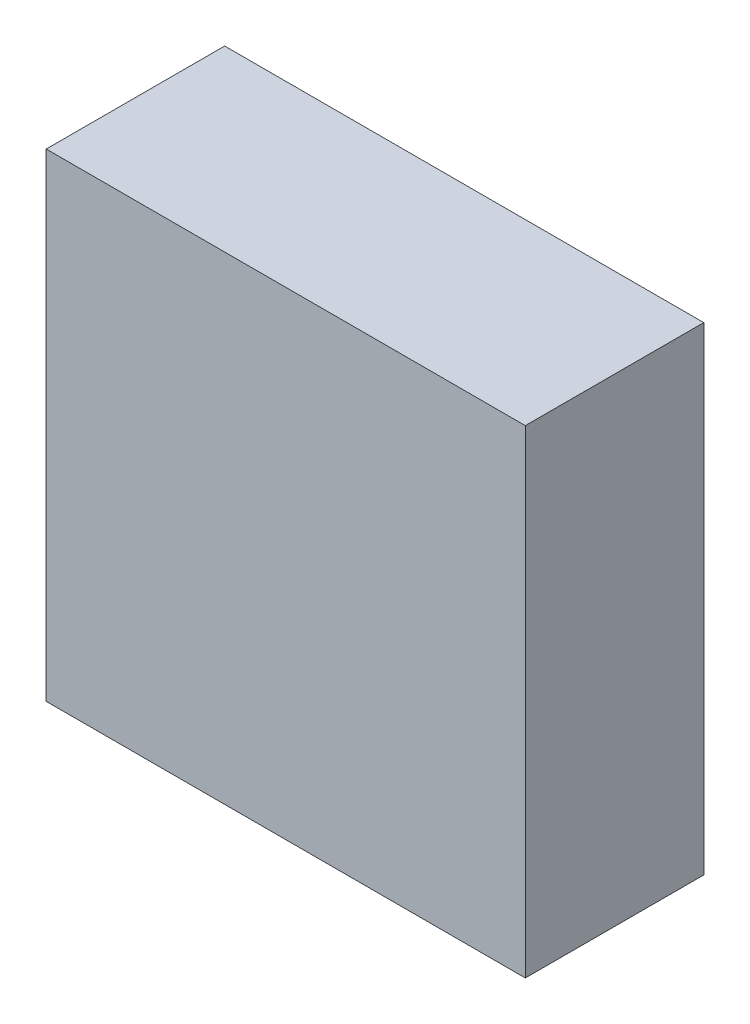
ISO-10303-21;
HEADER;
FILE_DESCRIPTION(('STEP AP214'),'2;1');
FILE_NAME('part.step','',(''),(''),'','','');
FILE_SCHEMA(('AUTOMOTIVE_DESIGN { 1 0 10303 214 1 1 1 1 }'));
ENDSEC;
DATA;
#1=APPLICATION_CONTEXT('core data for automotive mechanical design processes');
#2=APPLICATION_PROTOCOL_DEFINITION('international standard','automotive_design',2000,#1);
#3=PRODUCT_CONTEXT('',#1,'mechanical');
#4=PRODUCT('Part','Part','',(#3));
#5=PRODUCT_RELATED_PRODUCT_CATEGORY('part','',(#4));
#6=PRODUCT_DEFINITION_FORMATION('','',#4);
#7=PRODUCT_DEFINITION_CONTEXT('part definition',#1,'design');
#8=PRODUCT_DEFINITION('design','',#6,#7);
#9=PRODUCT_DEFINITION_SHAPE('','',#8);
#10=(LENGTH_UNIT() NAMED_UNIT(*) SI_UNIT(.MILLI.,.METRE.));
#11=(NAMED_UNIT(*) PLANE_ANGLE_UNIT() SI_UNIT($,.RADIAN.));
#12=(NAMED_UNIT(*) SI_UNIT($,.STERADIAN.) SOLID_ANGLE_UNIT());
#13=UNCERTAINTY_MEASURE_WITH_UNIT(LENGTH_MEASURE(1.E-05),#10,'distance_accuracy_value','');
#14=(GEOMETRIC_REPRESENTATION_CONTEXT(3) GLOBAL_UNCERTAINTY_ASSIGNED_CONTEXT((#13)) GLOBAL_UNIT_ASSIGNED_CONTEXT((#10,
#11,#12)) REPRESENTATION_CONTEXT('',''));
#15=CARTESIAN_POINT('',(0.,0.,0.));
#16=DIRECTION('',(0.,0.,1.));
#17=DIRECTION('',(1.,0.,0.));
#18=AXIS2_PLACEMENT_3D('',#15,#16,#17);
#19=CARTESIAN_POINT('',(-2.92535781741748,2.921,0.));
#20=DIRECTION('',(-1.,0.,0.));
#21=DIRECTION('',(0.,-1.,0.));
#22=AXIS2_PLACEMENT_3D('',#19,#20,#21);
#23=PLANE('',#22);
#24=DIRECTION('',(0.,1.,0.));
#25=VECTOR('',#24,1.);
#26=CARTESIAN_POINT('',(-2.92535781741748,-2.921,0.));
#27=LINE('',#26,#25);
#28=CARTESIAN_POINT('',(-2.92535781741748,-2.921,0.));
#29=VERTEX_POINT('',#28);
#30=CARTESIAN_POINT('',(-2.92535781741748,2.921,0.));
#31=VERTEX_POINT('',#30);
#32=EDGE_CURVE('E34',#29,#31,#27,.T.);
#33=ORIENTED_EDGE('',*,*,#32,.F.);
#34=DIRECTION('',(0.,0.,1.));
#35=VECTOR('',#34,1.);
#36=CARTESIAN_POINT('',(-2.92535781741748,-2.921,0.));
#37=LINE('',#36,#35);
#38=CARTESIAN_POINT('',(-2.92535781741748,-2.921,2.179));
#39=VERTEX_POINT('',#38);
#40=EDGE_CURVE('E10',#29,#39,#37,.T.);
#41=ORIENTED_EDGE('',*,*,#40,.T.);
#42=DIRECTION('',(0.,-1.,0.));
#43=VECTOR('',#42,1.);
#44=CARTESIAN_POINT('',(-2.92535781741748,-2.921,2.179));
#45=LINE('',#44,#43);
#46=CARTESIAN_POINT('',(-2.92535781741748,2.921,2.179));
#47=VERTEX_POINT('',#46);
#48=EDGE_CURVE('E78',#47,#39,#45,.T.);
#49=ORIENTED_EDGE('',*,*,#48,.F.);
#50=DIRECTION('',(0.,0.,1.));
#51=VECTOR('',#50,1.);
#52=CARTESIAN_POINT('',(-2.92535781741748,2.921,0.));
#53=LINE('',#52,#51);
#54=EDGE_CURVE('E26',#31,#47,#53,.T.);
#55=ORIENTED_EDGE('',*,*,#54,.F.);
#56=EDGE_LOOP('',(#33,#41,#49,#55));
#57=FACE_BOUND('',#56,.T.);
#58=ADVANCED_FACE('F16',(#57),#23,.T.);
#59=CARTESIAN_POINT('',(2.92535781741748,2.921,0.));
#60=DIRECTION('',(0.,1.,0.));
#61=DIRECTION('',(-1.,0.,0.));
#62=AXIS2_PLACEMENT_3D('',#59,#60,#61);
#63=PLANE('',#62);
#64=DIRECTION('',(1.,0.,0.));
#65=VECTOR('',#64,1.);
#66=CARTESIAN_POINT('',(-2.92535781741748,2.921,0.));
#67=LINE('',#66,#65);
#68=CARTESIAN_POINT('',(2.92535781741748,2.921,0.));
#69=VERTEX_POINT('',#68);
#70=EDGE_CURVE('E81',#31,#69,#67,.T.);
#71=ORIENTED_EDGE('',*,*,#70,.F.);
#72=ORIENTED_EDGE('',*,*,#54,.T.);
#73=DIRECTION('',(-1.,0.,0.));
#74=VECTOR('',#73,1.);
#75=CARTESIAN_POINT('',(-2.92535781741748,2.921,2.179));
#76=LINE('',#75,#74);
#77=CARTESIAN_POINT('',(2.92535781741748,2.921,2.179));
#78=VERTEX_POINT('',#77);
#79=EDGE_CURVE('E70',#78,#47,#76,.T.);
#80=ORIENTED_EDGE('',*,*,#79,.F.);
#81=DIRECTION('',(0.,0.,1.));
#82=VECTOR('',#81,1.);
#83=CARTESIAN_POINT('',(2.92535781741748,2.921,0.));
#84=LINE('',#83,#82);
#85=EDGE_CURVE('E66',#69,#78,#84,.T.);
#86=ORIENTED_EDGE('',*,*,#85,.F.);
#87=EDGE_LOOP('',(#71,#72,#80,#86));
#88=FACE_BOUND('',#87,.T.);
#89=ADVANCED_FACE('F90',(#88),#63,.T.);
#90=CARTESIAN_POINT('',(2.92535781741748,-2.921,0.));
#91=DIRECTION('',(1.,0.,0.));
#92=DIRECTION('',(0.,1.,0.));
#93=AXIS2_PLACEMENT_3D('',#90,#91,#92);
#94=PLANE('',#93);
#95=DIRECTION('',(0.,-1.,0.));
#96=VECTOR('',#95,1.);
#97=CARTESIAN_POINT('',(2.92535781741748,2.921,0.));
#98=LINE('',#97,#96);
#99=CARTESIAN_POINT('',(2.92535781741748,-2.921,0.));
#100=VERTEX_POINT('',#99);
#101=EDGE_CURVE('E54',#69,#100,#98,.T.);
#102=ORIENTED_EDGE('',*,*,#101,.F.);
#103=ORIENTED_EDGE('',*,*,#85,.T.);
#104=DIRECTION('',(0.,1.,0.));
#105=VECTOR('',#104,1.);
#106=CARTESIAN_POINT('',(2.92535781741748,2.921,2.179));
#107=LINE('',#106,#105);
#108=CARTESIAN_POINT('',(2.92535781741748,-2.921,2.179));
#109=VERTEX_POINT('',#108);
#110=EDGE_CURVE('E60',#109,#78,#107,.T.);
#111=ORIENTED_EDGE('',*,*,#110,.F.);
#112=DIRECTION('',(0.,0.,1.));
#113=VECTOR('',#112,1.);
#114=CARTESIAN_POINT('',(2.92535781741748,-2.921,0.));
#115=LINE('',#114,#113);
#116=EDGE_CURVE('E63',#100,#109,#115,.T.);
#117=ORIENTED_EDGE('',*,*,#116,.F.);
#118=EDGE_LOOP('',(#102,#103,#111,#117));
#119=FACE_BOUND('',#118,.T.);
#120=ADVANCED_FACE('F62',(#119),#94,.T.);
#121=CARTESIAN_POINT('',(-2.92535781741748,-2.921,0.));
#122=DIRECTION('',(0.,-1.,0.));
#123=DIRECTION('',(1.,0.,0.));
#124=AXIS2_PLACEMENT_3D('',#121,#122,#123);
#125=PLANE('',#124);
#126=DIRECTION('',(-1.,0.,0.));
#127=VECTOR('',#126,1.);
#128=CARTESIAN_POINT('',(2.92535781741748,-2.921,0.));
#129=LINE('',#128,#127);
#130=EDGE_CURVE('E75',#100,#29,#129,.T.);
#131=ORIENTED_EDGE('',*,*,#130,.F.);
#132=ORIENTED_EDGE('',*,*,#116,.T.);
#133=DIRECTION('',(1.,0.,0.));
#134=VECTOR('',#133,1.);
#135=CARTESIAN_POINT('',(2.92535781741748,-2.921,2.179));
#136=LINE('',#135,#134);
#137=EDGE_CURVE('E20',#39,#109,#136,.T.);
#138=ORIENTED_EDGE('',*,*,#137,.F.);
#139=ORIENTED_EDGE('',*,*,#40,.F.);
#140=EDGE_LOOP('',(#131,#132,#138,#139));
#141=FACE_BOUND('',#140,.T.);
#142=ADVANCED_FACE('F74',(#141),#125,.T.);
#143=CARTESIAN_POINT('',(0.,0.,2.179));
#144=DIRECTION('',(0.,0.,1.));
#145=DIRECTION('',(1.,0.,0.));
#146=AXIS2_PLACEMENT_3D('',#143,#144,#145);
#147=PLANE('',#146);
#148=ORIENTED_EDGE('',*,*,#137,.T.);
#149=ORIENTED_EDGE('',*,*,#110,.T.);
#150=ORIENTED_EDGE('',*,*,#79,.T.);
#151=ORIENTED_EDGE('',*,*,#48,.T.);
#152=EDGE_LOOP('',(#148,#149,#150,#151));
#153=FACE_BOUND('',#152,.T.);
#154=ADVANCED_FACE('F77',(#153),#147,.T.);
#155=CARTESIAN_POINT('',(0.,0.,0.));
#156=DIRECTION('',(0.,0.,1.));
#157=DIRECTION('',(0.,-1.,0.));
#158=AXIS2_PLACEMENT_3D('',#155,#156,#157);
#159=PLANE('',#158);
#160=ORIENTED_EDGE('',*,*,#130,.T.);
#161=ORIENTED_EDGE('',*,*,#32,.T.);
#162=ORIENTED_EDGE('',*,*,#70,.T.);
#163=ORIENTED_EDGE('',*,*,#101,.T.);
#164=EDGE_LOOP('',(#160,#161,#162,#163));
#165=FACE_BOUND('',#164,.T.);
#166=ADVANCED_FACE('F18',(#165),#159,.F.);
#167=CLOSED_SHELL('',(#58,#89,#120,#142,#154,#166));
#168=MANIFOLD_SOLID_BREP('B1',#167);
#169=ADVANCED_BREP_SHAPE_REPRESENTATION('',(#18,#168),#14);
#170=SHAPE_DEFINITION_REPRESENTATION(#9,#169);
ENDSEC;
END-ISO-10303-21;
